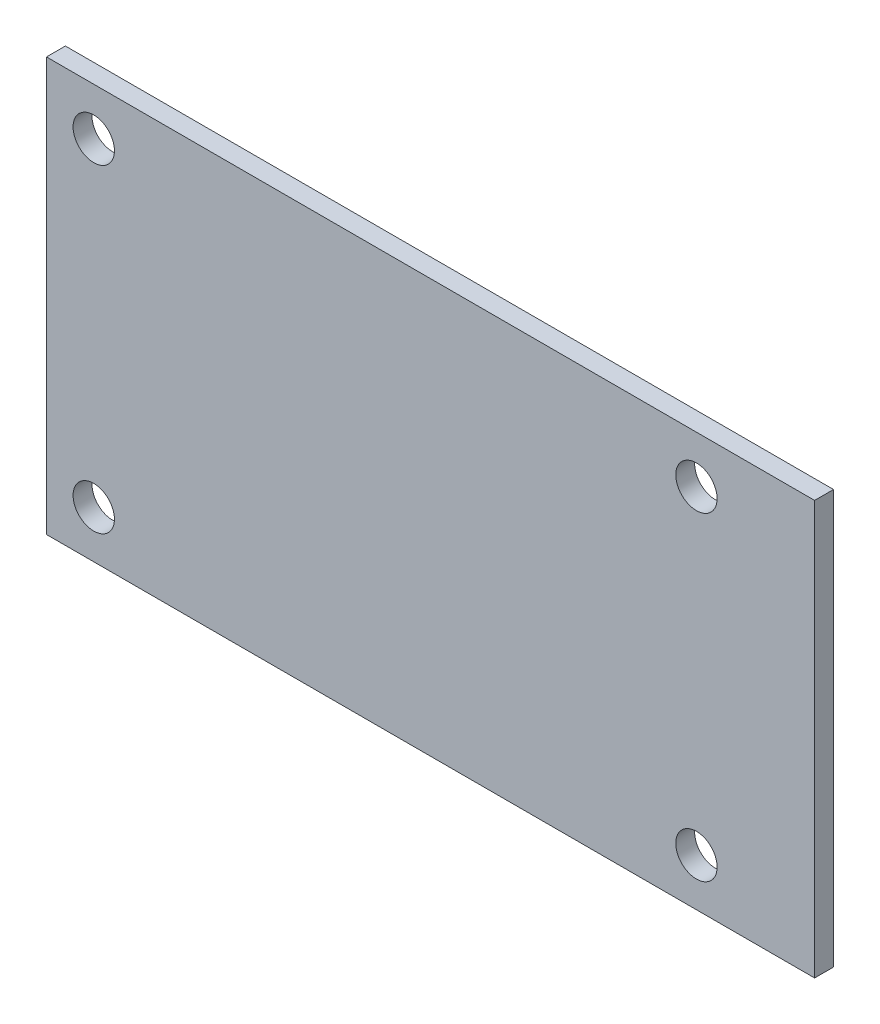
ISO-10303-21;
HEADER;
FILE_DESCRIPTION(('STEP AP214'),'2;1');
FILE_NAME('part.step','',(''),(''),'','','');
FILE_SCHEMA(('AUTOMOTIVE_DESIGN { 1 0 10303 214 1 1 1 1 }'));
ENDSEC;
DATA;
#1=APPLICATION_CONTEXT('core data for automotive mechanical design processes');
#2=APPLICATION_PROTOCOL_DEFINITION('international standard','automotive_design',2000,#1);
#3=PRODUCT_CONTEXT('',#1,'mechanical');
#4=PRODUCT('Part','Part','',(#3));
#5=PRODUCT_RELATED_PRODUCT_CATEGORY('part','',(#4));
#6=PRODUCT_DEFINITION_FORMATION('','',#4);
#7=PRODUCT_DEFINITION_CONTEXT('part definition',#1,'design');
#8=PRODUCT_DEFINITION('design','',#6,#7);
#9=PRODUCT_DEFINITION_SHAPE('','',#8);
#10=(LENGTH_UNIT() NAMED_UNIT(*) SI_UNIT(.MILLI.,.METRE.));
#11=(NAMED_UNIT(*) PLANE_ANGLE_UNIT() SI_UNIT($,.RADIAN.));
#12=(NAMED_UNIT(*) SI_UNIT($,.STERADIAN.) SOLID_ANGLE_UNIT());
#13=UNCERTAINTY_MEASURE_WITH_UNIT(LENGTH_MEASURE(1.E-05),#10,'distance_accuracy_value','');
#14=(GEOMETRIC_REPRESENTATION_CONTEXT(3) GLOBAL_UNCERTAINTY_ASSIGNED_CONTEXT((#13)) GLOBAL_UNIT_ASSIGNED_CONTEXT((#10,
#11,#12)) REPRESENTATION_CONTEXT('',''));
#15=CARTESIAN_POINT('',(0.,0.,0.));
#16=DIRECTION('',(0.,0.,1.));
#17=DIRECTION('',(1.,0.,0.));
#18=AXIS2_PLACEMENT_3D('',#15,#16,#17);
#19=CARTESIAN_POINT('',(32.5,17.5,1.6));
#20=DIRECTION('',(-1.,0.,0.));
#21=DIRECTION('',(0.,-1.,0.));
#22=AXIS2_PLACEMENT_3D('',#19,#20,#21);
#23=PLANE('',#22);
#24=DIRECTION('',(0.,1.,0.));
#25=VECTOR('',#24,1.);
#26=CARTESIAN_POINT('',(32.5,17.5,0.));
#27=LINE('',#26,#25);
#28=CARTESIAN_POINT('',(32.5,-17.5,0.));
#29=VERTEX_POINT('',#28);
#30=CARTESIAN_POINT('',(32.5,17.5,0.));
#31=VERTEX_POINT('',#30);
#32=EDGE_CURVE('E100',#29,#31,#27,.T.);
#33=ORIENTED_EDGE('',*,*,#32,.T.);
#34=DIRECTION('',(0.,0.,-1.));
#35=VECTOR('',#34,1.);
#36=CARTESIAN_POINT('',(32.5,17.5,1.6));
#37=LINE('',#36,#35);
#38=CARTESIAN_POINT('',(32.5,17.5,1.6));
#39=VERTEX_POINT('',#38);
#40=EDGE_CURVE('E11',#39,#31,#37,.T.);
#41=ORIENTED_EDGE('',*,*,#40,.F.);
#42=DIRECTION('',(0.,1.,0.));
#43=VECTOR('',#42,1.);
#44=CARTESIAN_POINT('',(32.5,17.5,1.6));
#45=LINE('',#44,#43);
#46=CARTESIAN_POINT('',(32.5,-17.5,1.6));
#47=VERTEX_POINT('',#46);
#48=EDGE_CURVE('E88',#47,#39,#45,.T.);
#49=ORIENTED_EDGE('',*,*,#48,.F.);
#50=DIRECTION('',(0.,0.,-1.));
#51=VECTOR('',#50,1.);
#52=CARTESIAN_POINT('',(32.5,-17.5,1.6));
#53=LINE('',#52,#51);
#54=EDGE_CURVE('E96',#47,#29,#53,.T.);
#55=ORIENTED_EDGE('',*,*,#54,.T.);
#56=EDGE_LOOP('',(#33,#41,#49,#55));
#57=FACE_BOUND('',#56,.T.);
#58=ADVANCED_FACE('F37',(#57),#23,.F.);
#59=CARTESIAN_POINT('',(-32.5,17.5,1.6));
#60=DIRECTION('',(0.,-1.,0.));
#61=DIRECTION('',(0.,0.,-1.));
#62=AXIS2_PLACEMENT_3D('',#59,#60,#61);
#63=PLANE('',#62);
#64=DIRECTION('',(-1.,0.,0.));
#65=VECTOR('',#64,1.);
#66=CARTESIAN_POINT('',(-32.5,17.5,0.));
#67=LINE('',#66,#65);
#68=CARTESIAN_POINT('',(-32.5,17.5,0.));
#69=VERTEX_POINT('',#68);
#70=EDGE_CURVE('E92',#31,#69,#67,.T.);
#71=ORIENTED_EDGE('',*,*,#70,.T.);
#72=DIRECTION('',(0.,0.,-1.));
#73=VECTOR('',#72,1.);
#74=CARTESIAN_POINT('',(-32.5,17.5,1.6));
#75=LINE('',#74,#73);
#76=CARTESIAN_POINT('',(-32.5,17.5,1.6));
#77=VERTEX_POINT('',#76);
#78=EDGE_CURVE('E45',#77,#69,#75,.T.);
#79=ORIENTED_EDGE('',*,*,#78,.F.);
#80=DIRECTION('',(-1.,0.,0.));
#81=VECTOR('',#80,1.);
#82=CARTESIAN_POINT('',(-32.5,17.5,1.6));
#83=LINE('',#82,#81);
#84=EDGE_CURVE('E83',#39,#77,#83,.T.);
#85=ORIENTED_EDGE('',*,*,#84,.F.);
#86=ORIENTED_EDGE('',*,*,#40,.T.);
#87=EDGE_LOOP('',(#71,#79,#85,#86));
#88=FACE_BOUND('',#87,.T.);
#89=ADVANCED_FACE('F91',(#88),#63,.F.);
#90=CARTESIAN_POINT('',(-32.5,17.5,1.6));
#91=DIRECTION('',(1.,0.,0.));
#92=DIRECTION('',(0.,0.,-1.));
#93=AXIS2_PLACEMENT_3D('',#90,#91,#92);
#94=PLANE('',#93);
#95=DIRECTION('',(0.,-1.,0.));
#96=VECTOR('',#95,1.);
#97=CARTESIAN_POINT('',(-32.5,17.5,0.));
#98=LINE('',#97,#96);
#99=CARTESIAN_POINT('',(-32.5,-17.5,0.));
#100=VERTEX_POINT('',#99);
#101=EDGE_CURVE('E70',#69,#100,#98,.T.);
#102=ORIENTED_EDGE('',*,*,#101,.T.);
#103=DIRECTION('',(0.,0.,-1.));
#104=VECTOR('',#103,1.);
#105=CARTESIAN_POINT('',(-32.5,-17.5,1.6));
#106=LINE('',#105,#104);
#107=CARTESIAN_POINT('',(-32.5,-17.5,1.6));
#108=VERTEX_POINT('',#107);
#109=EDGE_CURVE('E93',#108,#100,#106,.T.);
#110=ORIENTED_EDGE('',*,*,#109,.F.);
#111=DIRECTION('',(0.,-1.,0.));
#112=VECTOR('',#111,1.);
#113=CARTESIAN_POINT('',(-32.5,17.5,1.6));
#114=LINE('',#113,#112);
#115=EDGE_CURVE('E86',#77,#108,#114,.T.);
#116=ORIENTED_EDGE('',*,*,#115,.F.);
#117=ORIENTED_EDGE('',*,*,#78,.T.);
#118=EDGE_LOOP('',(#102,#110,#116,#117));
#119=FACE_BOUND('',#118,.T.);
#120=ADVANCED_FACE('F94',(#119),#94,.F.);
#121=CARTESIAN_POINT('',(-32.5,-17.5,1.6));
#122=DIRECTION('',(0.,1.,0.));
#123=DIRECTION('',(0.,0.,1.));
#124=AXIS2_PLACEMENT_3D('',#121,#122,#123);
#125=PLANE('',#124);
#126=DIRECTION('',(1.,0.,0.));
#127=VECTOR('',#126,1.);
#128=CARTESIAN_POINT('',(-32.5,-17.5,0.));
#129=LINE('',#128,#127);
#130=EDGE_CURVE('E76',#100,#29,#129,.T.);
#131=ORIENTED_EDGE('',*,*,#130,.T.);
#132=ORIENTED_EDGE('',*,*,#54,.F.);
#133=DIRECTION('',(1.,0.,0.));
#134=VECTOR('',#133,1.);
#135=CARTESIAN_POINT('',(-32.5,-17.5,1.6));
#136=LINE('',#135,#134);
#137=EDGE_CURVE('E53',#108,#47,#136,.T.);
#138=ORIENTED_EDGE('',*,*,#137,.F.);
#139=ORIENTED_EDGE('',*,*,#109,.T.);
#140=EDGE_LOOP('',(#131,#132,#138,#139));
#141=FACE_BOUND('',#140,.T.);
#142=ADVANCED_FACE('F108',(#141),#125,.F.);
#143=CARTESIAN_POINT('',(0.,0.,1.6));
#144=DIRECTION('',(0.,0.,1.));
#145=DIRECTION('',(1.,0.,0.));
#146=AXIS2_PLACEMENT_3D('',#143,#144,#145);
#147=PLANE('',#146);
#148=CARTESIAN_POINT('',(-28.5,-13.5,1.6));
#149=DIRECTION('',(0.,0.,1.));
#150=DIRECTION('',(1.,0.,0.));
#151=AXIS2_PLACEMENT_3D('',#148,#149,#150);
#152=CIRCLE('',#151,1.75);
#153=CARTESIAN_POINT('',(-26.75,-13.5,1.6));
#154=VERTEX_POINT('',#153);
#155=EDGE_CURVE('E117',#154,#154,#152,.T.);
#156=ORIENTED_EDGE('',*,*,#155,.F.);
#157=EDGE_LOOP('',(#156));
#158=FACE_BOUND('',#157,.T.);
#159=CARTESIAN_POINT('',(22.5,13.5,1.6));
#160=DIRECTION('',(0.,0.,1.));
#161=DIRECTION('',(1.,0.,0.));
#162=AXIS2_PLACEMENT_3D('',#159,#160,#161);
#163=CIRCLE('',#162,1.75);
#164=CARTESIAN_POINT('',(24.25,13.5,1.6));
#165=VERTEX_POINT('',#164);
#166=EDGE_CURVE('E123',#165,#165,#163,.T.);
#167=ORIENTED_EDGE('',*,*,#166,.F.);
#168=EDGE_LOOP('',(#167));
#169=FACE_BOUND('',#168,.T.);
#170=CARTESIAN_POINT('',(22.5,-13.5,1.6));
#171=DIRECTION('',(0.,0.,1.));
#172=DIRECTION('',(1.,0.,0.));
#173=AXIS2_PLACEMENT_3D('',#170,#171,#172);
#174=CIRCLE('',#173,1.75);
#175=CARTESIAN_POINT('',(24.25,-13.5,1.6));
#176=VERTEX_POINT('',#175);
#177=EDGE_CURVE('E124',#176,#176,#174,.T.);
#178=ORIENTED_EDGE('',*,*,#177,.F.);
#179=EDGE_LOOP('',(#178));
#180=FACE_BOUND('',#179,.T.);
#181=CARTESIAN_POINT('',(-28.5,13.5,1.6));
#182=DIRECTION('',(0.,0.,1.));
#183=DIRECTION('',(1.,0.,0.));
#184=AXIS2_PLACEMENT_3D('',#181,#182,#183);
#185=CIRCLE('',#184,1.75);
#186=CARTESIAN_POINT('',(-26.75,13.5,1.6));
#187=VERTEX_POINT('',#186);
#188=EDGE_CURVE('E114',#187,#187,#185,.T.);
#189=ORIENTED_EDGE('',*,*,#188,.F.);
#190=EDGE_LOOP('',(#189));
#191=FACE_BOUND('',#190,.T.);
#192=ORIENTED_EDGE('',*,*,#48,.T.);
#193=ORIENTED_EDGE('',*,*,#84,.T.);
#194=ORIENTED_EDGE('',*,*,#115,.T.);
#195=ORIENTED_EDGE('',*,*,#137,.T.);
#196=EDGE_LOOP('',(#192,#193,#194,#195));
#197=FACE_BOUND('',#196,.T.);
#198=ADVANCED_FACE('F84',(#158,#169,#180,#191,#197),#147,.T.);
#199=CARTESIAN_POINT('',(0.,0.,0.));
#200=DIRECTION('',(0.,0.,1.));
#201=DIRECTION('',(1.,0.,0.));
#202=AXIS2_PLACEMENT_3D('',#199,#200,#201);
#203=PLANE('',#202);
#204=CARTESIAN_POINT('',(-28.5,-13.5,0.));
#205=DIRECTION('',(0.,0.,1.));
#206=DIRECTION('',(1.,0.,0.));
#207=AXIS2_PLACEMENT_3D('',#204,#205,#206);
#208=CIRCLE('',#207,1.75);
#209=CARTESIAN_POINT('',(-26.75,-13.5,0.));
#210=VERTEX_POINT('',#209);
#211=EDGE_CURVE('E127',#210,#210,#208,.T.);
#212=ORIENTED_EDGE('',*,*,#211,.T.);
#213=EDGE_LOOP('',(#212));
#214=FACE_BOUND('',#213,.T.);
#215=CARTESIAN_POINT('',(22.5,13.5,0.));
#216=DIRECTION('',(0.,0.,1.));
#217=DIRECTION('',(1.,0.,0.));
#218=AXIS2_PLACEMENT_3D('',#215,#216,#217);
#219=CIRCLE('',#218,1.75);
#220=CARTESIAN_POINT('',(24.25,13.5,0.));
#221=VERTEX_POINT('',#220);
#222=EDGE_CURVE('E120',#221,#221,#219,.T.);
#223=ORIENTED_EDGE('',*,*,#222,.T.);
#224=EDGE_LOOP('',(#223));
#225=FACE_BOUND('',#224,.T.);
#226=CARTESIAN_POINT('',(22.5,-13.5,0.));
#227=DIRECTION('',(0.,0.,1.));
#228=DIRECTION('',(1.,0.,0.));
#229=AXIS2_PLACEMENT_3D('',#226,#227,#228);
#230=CIRCLE('',#229,1.75);
#231=CARTESIAN_POINT('',(24.25,-13.5,0.));
#232=VERTEX_POINT('',#231);
#233=EDGE_CURVE('E132',#232,#232,#230,.T.);
#234=ORIENTED_EDGE('',*,*,#233,.T.);
#235=EDGE_LOOP('',(#234));
#236=FACE_BOUND('',#235,.T.);
#237=CARTESIAN_POINT('',(-28.5,13.5,0.));
#238=DIRECTION('',(0.,0.,1.));
#239=DIRECTION('',(1.,0.,0.));
#240=AXIS2_PLACEMENT_3D('',#237,#238,#239);
#241=CIRCLE('',#240,1.75);
#242=CARTESIAN_POINT('',(-26.75,13.5,0.));
#243=VERTEX_POINT('',#242);
#244=EDGE_CURVE('E103',#243,#243,#241,.T.);
#245=ORIENTED_EDGE('',*,*,#244,.T.);
#246=EDGE_LOOP('',(#245));
#247=FACE_BOUND('',#246,.T.);
#248=ORIENTED_EDGE('',*,*,#32,.F.);
#249=ORIENTED_EDGE('',*,*,#130,.F.);
#250=ORIENTED_EDGE('',*,*,#101,.F.);
#251=ORIENTED_EDGE('',*,*,#70,.F.);
#252=EDGE_LOOP('',(#248,#249,#250,#251));
#253=FACE_BOUND('',#252,.T.);
#254=ADVANCED_FACE('F111',(#214,#225,#236,#247,#253),#203,.F.);
#255=CARTESIAN_POINT('',(-28.5,13.5,0.));
#256=DIRECTION('',(0.,0.,1.));
#257=DIRECTION('',(1.,0.,0.));
#258=AXIS2_PLACEMENT_3D('',#255,#256,#257);
#259=CYLINDRICAL_SURFACE('',#258,1.75);
#260=ORIENTED_EDGE('',*,*,#244,.F.);
#261=EDGE_LOOP('',(#260));
#262=FACE_BOUND('',#261,.T.);
#263=ORIENTED_EDGE('',*,*,#188,.T.);
#264=EDGE_LOOP('',(#263));
#265=FACE_BOUND('',#264,.T.);
#266=ADVANCED_FACE('F146',(#262,#265),#259,.F.);
#267=CARTESIAN_POINT('',(22.5,-13.5,0.));
#268=DIRECTION('',(0.,0.,1.));
#269=DIRECTION('',(1.,0.,0.));
#270=AXIS2_PLACEMENT_3D('',#267,#268,#269);
#271=CYLINDRICAL_SURFACE('',#270,1.75);
#272=ORIENTED_EDGE('',*,*,#233,.F.);
#273=EDGE_LOOP('',(#272));
#274=FACE_BOUND('',#273,.T.);
#275=ORIENTED_EDGE('',*,*,#177,.T.);
#276=EDGE_LOOP('',(#275));
#277=FACE_BOUND('',#276,.T.);
#278=ADVANCED_FACE('F138',(#274,#277),#271,.F.);
#279=CARTESIAN_POINT('',(22.5,13.5,0.));
#280=DIRECTION('',(0.,0.,1.));
#281=DIRECTION('',(1.,0.,0.));
#282=AXIS2_PLACEMENT_3D('',#279,#280,#281);
#283=CYLINDRICAL_SURFACE('',#282,1.75);
#284=ORIENTED_EDGE('',*,*,#222,.F.);
#285=EDGE_LOOP('',(#284));
#286=FACE_BOUND('',#285,.T.);
#287=ORIENTED_EDGE('',*,*,#166,.T.);
#288=EDGE_LOOP('',(#287));
#289=FACE_BOUND('',#288,.T.);
#290=ADVANCED_FACE('F154',(#286,#289),#283,.F.);
#291=CARTESIAN_POINT('',(-28.5,-13.5,0.));
#292=DIRECTION('',(0.,0.,1.));
#293=DIRECTION('',(1.,0.,0.));
#294=AXIS2_PLACEMENT_3D('',#291,#292,#293);
#295=CYLINDRICAL_SURFACE('',#294,1.75);
#296=ORIENTED_EDGE('',*,*,#211,.F.);
#297=EDGE_LOOP('',(#296));
#298=FACE_BOUND('',#297,.T.);
#299=ORIENTED_EDGE('',*,*,#155,.T.);
#300=EDGE_LOOP('',(#299));
#301=FACE_BOUND('',#300,.T.);
#302=ADVANCED_FACE('F205',(#298,#301),#295,.F.);
#303=CLOSED_SHELL('',(#58,#89,#120,#142,#198,#254,#266,#278,#290,#302));
#304=MANIFOLD_SOLID_BREP('B2',#303);
#305=ADVANCED_BREP_SHAPE_REPRESENTATION('',(#18,#304),#14);
#306=SHAPE_DEFINITION_REPRESENTATION(#9,#305);
ENDSEC;
END-ISO-10303-21;
